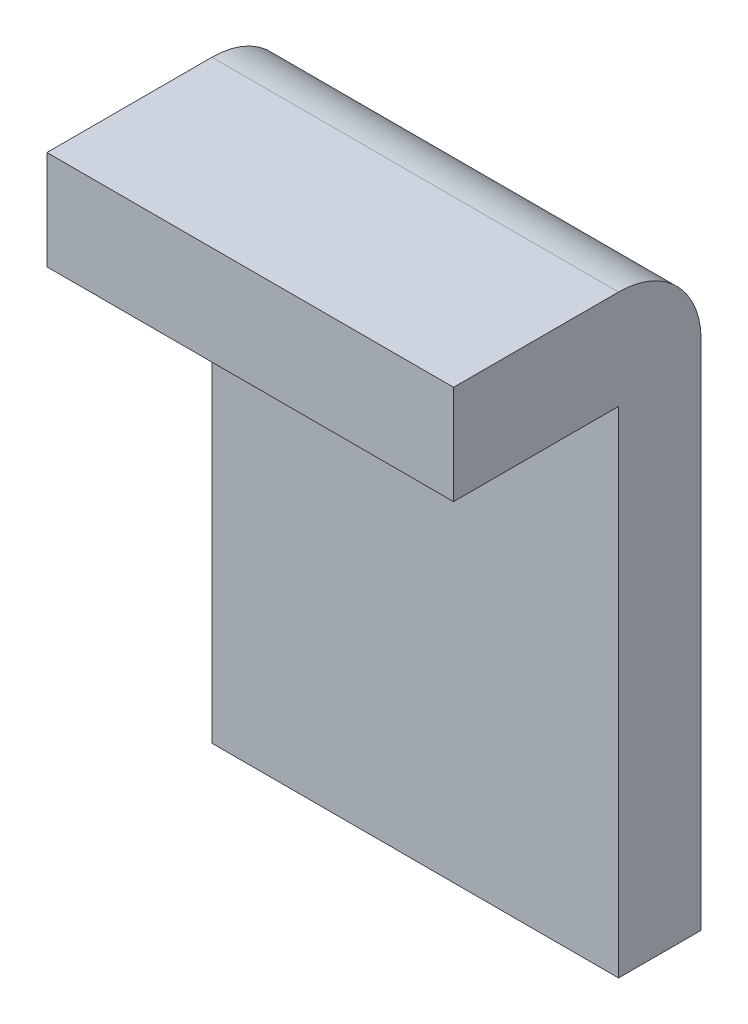
ISO-10303-21;
HEADER;
FILE_DESCRIPTION(('STEP AP214'),'2;1');
FILE_NAME('part.step','',(''),(''),'','','');
FILE_SCHEMA(('AUTOMOTIVE_DESIGN { 1 0 10303 214 1 1 1 1 }'));
ENDSEC;
DATA;
#1=APPLICATION_CONTEXT('core data for automotive mechanical design processes');
#2=APPLICATION_PROTOCOL_DEFINITION('international standard','automotive_design',2000,#1);
#3=PRODUCT_CONTEXT('',#1,'mechanical');
#4=PRODUCT('Part','Part','',(#3));
#5=PRODUCT_RELATED_PRODUCT_CATEGORY('part','',(#4));
#6=PRODUCT_DEFINITION_FORMATION('','',#4);
#7=PRODUCT_DEFINITION_CONTEXT('part definition',#1,'design');
#8=PRODUCT_DEFINITION('design','',#6,#7);
#9=PRODUCT_DEFINITION_SHAPE('','',#8);
#10=(LENGTH_UNIT() NAMED_UNIT(*) SI_UNIT(.MILLI.,.METRE.));
#11=(NAMED_UNIT(*) PLANE_ANGLE_UNIT() SI_UNIT($,.RADIAN.));
#12=(NAMED_UNIT(*) SI_UNIT($,.STERADIAN.) SOLID_ANGLE_UNIT());
#13=UNCERTAINTY_MEASURE_WITH_UNIT(LENGTH_MEASURE(1.E-05),#10,'distance_accuracy_value','');
#14=(GEOMETRIC_REPRESENTATION_CONTEXT(3) GLOBAL_UNCERTAINTY_ASSIGNED_CONTEXT((#13)) GLOBAL_UNIT_ASSIGNED_CONTEXT((#10,
#11,#12)) REPRESENTATION_CONTEXT('',''));
#15=CARTESIAN_POINT('',(0.,0.,0.));
#16=DIRECTION('',(0.,0.,1.));
#17=DIRECTION('',(1.,0.,0.));
#18=AXIS2_PLACEMENT_3D('',#15,#16,#17);
#19=CARTESIAN_POINT('',(-8.34906661620967,8.30000000000001,4.25467377707551));
#20=DIRECTION('',(0.,1.,0.));
#21=DIRECTION('',(0.,0.,1.));
#22=AXIS2_PLACEMENT_3D('',#19,#20,#21);
#23=PLANE('',#22);
#24=DIRECTION('',(1.,0.,0.));
#25=VECTOR('',#24,1.);
#26=CARTESIAN_POINT('',(-3.38158711942134,8.30000000000001,4.25467377707552));
#27=LINE('',#26,#25);
#28=CARTESIAN_POINT('',(-3.38158711942134,8.30000000000001,4.25467377707551));
#29=VERTEX_POINT('',#28);
#30=CARTESIAN_POINT('',(-2.14943636298061,8.30000000000001,4.25467377707551));
#31=VERTEX_POINT('',#30);
#32=EDGE_CURVE('E133',#29,#31,#27,.T.);
#33=ORIENTED_EDGE('',*,*,#32,.F.);
#34=DIRECTION('',(0.,0.,1.));
#35=VECTOR('',#34,1.);
#36=CARTESIAN_POINT('',(-3.38158711942134,8.30000000000001,4.25467377707553));
#37=LINE('',#36,#35);
#38=CARTESIAN_POINT('',(-3.38158711942134,8.30000000000001,3.75467377707551));
#39=VERTEX_POINT('',#38);
#40=EDGE_CURVE('E113',#39,#29,#37,.T.);
#41=ORIENTED_EDGE('',*,*,#40,.F.);
#42=DIRECTION('',(1.,0.,0.));
#43=VECTOR('',#42,1.);
#44=CARTESIAN_POINT('',(-8.34906661620967,8.30000000000001,3.75467377707551));
#45=LINE('',#44,#43);
#46=CARTESIAN_POINT('',(-2.14943636298061,8.30000000000001,3.75467377707551));
#47=VERTEX_POINT('',#46);
#48=EDGE_CURVE('E130',#39,#47,#45,.T.);
#49=ORIENTED_EDGE('',*,*,#48,.T.);
#50=DIRECTION('',(0.,0.,-1.));
#51=VECTOR('',#50,1.);
#52=CARTESIAN_POINT('',(-2.14943636298061,8.30000000000001,4.25467377707553));
#53=LINE('',#52,#51);
#54=EDGE_CURVE('E129',#31,#47,#53,.T.);
#55=ORIENTED_EDGE('',*,*,#54,.F.);
#56=EDGE_LOOP('',(#33,#41,#49,#55));
#57=FACE_BOUND('',#56,.T.);
#58=ADVANCED_FACE('F17',(#57),#23,.F.);
#59=CARTESIAN_POINT('',(-3.38158711942134,5.35753839337144,4.25467377707553));
#60=DIRECTION('',(0.,0.,1.));
#61=DIRECTION('',(0.,-1.,0.));
#62=AXIS2_PLACEMENT_3D('',#59,#60,#61);
#63=PLANE('',#62);
#64=DIRECTION('',(1.,0.,0.));
#65=VECTOR('',#64,1.);
#66=CARTESIAN_POINT('',(-8.34906661620967,8.6,4.25467377707551));
#67=LINE('',#66,#65);
#68=CARTESIAN_POINT('',(-2.14943636298061,8.6,4.25467377707551));
#69=VERTEX_POINT('',#68);
#70=CARTESIAN_POINT('',(-3.38158711942134,8.6,4.25467377707551));
#71=VERTEX_POINT('',#70);
#72=EDGE_CURVE('E131',#69,#71,#67,.F.);
#73=ORIENTED_EDGE('',*,*,#72,.T.);
#74=DIRECTION('',(0.,1.,0.));
#75=VECTOR('',#74,1.);
#76=CARTESIAN_POINT('',(-3.38158711942134,5.35753839337144,4.25467377707551));
#77=LINE('',#76,#75);
#78=EDGE_CURVE('E136',#29,#71,#77,.T.);
#79=ORIENTED_EDGE('',*,*,#78,.F.);
#80=ORIENTED_EDGE('',*,*,#32,.T.);
#81=DIRECTION('',(0.,1.,0.));
#82=VECTOR('',#81,1.);
#83=CARTESIAN_POINT('',(-2.14943636298061,5.35753839337144,4.25467377707551));
#84=LINE('',#83,#82);
#85=EDGE_CURVE('E120',#69,#31,#84,.F.);
#86=ORIENTED_EDGE('',*,*,#85,.F.);
#87=EDGE_LOOP('',(#73,#79,#80,#86));
#88=FACE_BOUND('',#87,.T.);
#89=ADVANCED_FACE('F172',(#88),#63,.T.);
#90=CARTESIAN_POINT('',(-8.34906661620967,8.6,4.25467377707551));
#91=DIRECTION('',(0.,-1.,0.));
#92=DIRECTION('',(0.,0.,-1.));
#93=AXIS2_PLACEMENT_3D('',#90,#91,#92);
#94=PLANE('',#93);
#95=DIRECTION('',(1.,0.,0.));
#96=VECTOR('',#95,1.);
#97=CARTESIAN_POINT('',(-8.34906661620967,8.6,3.75467377707551));
#98=LINE('',#97,#96);
#99=CARTESIAN_POINT('',(-3.38158711942134,8.6,3.7546737770755));
#100=VERTEX_POINT('',#99);
#101=CARTESIAN_POINT('',(-2.14943636298061,8.6,3.7546737770755));
#102=VERTEX_POINT('',#101);
#103=EDGE_CURVE('E79',#100,#102,#98,.T.);
#104=ORIENTED_EDGE('',*,*,#103,.F.);
#105=DIRECTION('',(0.,0.,1.));
#106=VECTOR('',#105,1.);
#107=CARTESIAN_POINT('',(-3.38158711942134,8.6,4.25467377707553));
#108=LINE('',#107,#106);
#109=EDGE_CURVE('E139',#71,#100,#108,.F.);
#110=ORIENTED_EDGE('',*,*,#109,.F.);
#111=ORIENTED_EDGE('',*,*,#72,.F.);
#112=DIRECTION('',(0.,0.,-1.));
#113=VECTOR('',#112,1.);
#114=CARTESIAN_POINT('',(-2.14943636298061,8.6,4.25467377707553));
#115=LINE('',#114,#113);
#116=EDGE_CURVE('E83',#102,#69,#115,.F.);
#117=ORIENTED_EDGE('',*,*,#116,.F.);
#118=EDGE_LOOP('',(#104,#110,#111,#117));
#119=FACE_BOUND('',#118,.T.);
#120=ADVANCED_FACE('F169',(#119),#94,.F.);
#121=CARTESIAN_POINT('',(-8.34906661620967,8.30000000000001,3.75467377707551));
#122=DIRECTION('',(0.,0.,-1.));
#123=DIRECTION('',(0.,1.,0.));
#124=AXIS2_PLACEMENT_3D('',#121,#122,#123);
#125=PLANE('',#124);
#126=ORIENTED_EDGE('',*,*,#48,.F.);
#127=DIRECTION('',(0.,1.,0.));
#128=VECTOR('',#127,1.);
#129=CARTESIAN_POINT('',(-3.38158711942134,5.35753839337144,3.75467377707551));
#130=LINE('',#129,#128);
#131=CARTESIAN_POINT('',(-3.38158711942134,6.8,3.75467377707551));
#132=VERTEX_POINT('',#131);
#133=EDGE_CURVE('E95',#132,#39,#130,.T.);
#134=ORIENTED_EDGE('',*,*,#133,.F.);
#135=DIRECTION('',(1.,0.,0.));
#136=VECTOR('',#135,1.);
#137=CARTESIAN_POINT('',(-15.8147962412963,6.8,3.75467377707551));
#138=LINE('',#137,#136);
#139=CARTESIAN_POINT('',(-2.14943636298061,6.8,3.75467377707551));
#140=VERTEX_POINT('',#139);
#141=EDGE_CURVE('E114',#140,#132,#138,.F.);
#142=ORIENTED_EDGE('',*,*,#141,.F.);
#143=DIRECTION('',(0.,1.,0.));
#144=VECTOR('',#143,1.);
#145=CARTESIAN_POINT('',(-2.14943636298061,5.35753839337144,3.75467377707551));
#146=LINE('',#145,#144);
#147=EDGE_CURVE('E84',#47,#140,#146,.F.);
#148=ORIENTED_EDGE('',*,*,#147,.F.);
#149=EDGE_LOOP('',(#126,#134,#142,#148));
#150=FACE_BOUND('',#149,.T.);
#151=ADVANCED_FACE('F178',(#150),#125,.F.);
#152=CARTESIAN_POINT('',(-8.34906661620967,8.35,3.7546737770755));
#153=DIRECTION('',(1.,0.,0.));
#154=DIRECTION('',(0.,0.,-1.));
#155=AXIS2_PLACEMENT_3D('',#152,#153,#154);
#156=CYLINDRICAL_SURFACE('',#155,0.249999999999996);
#157=CARTESIAN_POINT('',(-3.38158711942134,8.35,3.7546737770755));
#158=DIRECTION('',(1.,0.,0.));
#159=DIRECTION('',(0.,0.,-1.));
#160=AXIS2_PLACEMENT_3D('',#157,#158,#159);
#161=CIRCLE('',#160,0.249999999999996);
#162=CARTESIAN_POINT('',(-3.38158711942134,8.35,3.50467377707551));
#163=VERTEX_POINT('',#162);
#164=EDGE_CURVE('E106',#100,#163,#161,.F.);
#165=ORIENTED_EDGE('',*,*,#164,.F.);
#166=ORIENTED_EDGE('',*,*,#103,.T.);
#167=CARTESIAN_POINT('',(-2.14943636298061,8.35,3.7546737770755));
#168=DIRECTION('',(1.,0.,0.));
#169=DIRECTION('',(0.,0.,-1.));
#170=AXIS2_PLACEMENT_3D('',#167,#168,#169);
#171=CIRCLE('',#170,0.249999999999996);
#172=CARTESIAN_POINT('',(-2.14943636298061,8.35,3.50467377707551));
#173=VERTEX_POINT('',#172);
#174=EDGE_CURVE('E20',#173,#102,#171,.T.);
#175=ORIENTED_EDGE('',*,*,#174,.F.);
#176=DIRECTION('',(1.,0.,0.));
#177=VECTOR('',#176,1.);
#178=CARTESIAN_POINT('',(-3.38158711942134,8.35,3.50467377707551));
#179=LINE('',#178,#177);
#180=EDGE_CURVE('E77',#163,#173,#179,.T.);
#181=ORIENTED_EDGE('',*,*,#180,.F.);
#182=EDGE_LOOP('',(#165,#166,#175,#181));
#183=FACE_BOUND('',#182,.T.);
#184=ADVANCED_FACE('F75',(#183),#156,.T.);
#185=CARTESIAN_POINT('',(-2.14943636298061,5.35753839337144,4.25467377707553));
#186=DIRECTION('',(1.,0.,0.));
#187=DIRECTION('',(0.,0.,-1.));
#188=AXIS2_PLACEMENT_3D('',#185,#186,#187);
#189=PLANE('',#188);
#190=ORIENTED_EDGE('',*,*,#116,.T.);
#191=ORIENTED_EDGE('',*,*,#85,.T.);
#192=ORIENTED_EDGE('',*,*,#54,.T.);
#193=ORIENTED_EDGE('',*,*,#147,.T.);
#194=DIRECTION('',(0.,0.,-1.));
#195=VECTOR('',#194,1.);
#196=CARTESIAN_POINT('',(-2.14943636298061,6.80000000000003,12.5046737770755));
#197=LINE('',#196,#195);
#198=CARTESIAN_POINT('',(-2.14943636298061,6.8,3.50467377707552));
#199=VERTEX_POINT('',#198);
#200=EDGE_CURVE('E90',#199,#140,#197,.F.);
#201=ORIENTED_EDGE('',*,*,#200,.F.);
#202=DIRECTION('',(0.,1.,0.));
#203=VECTOR('',#202,1.);
#204=CARTESIAN_POINT('',(-2.14943636298061,5.35753839337143,3.50467377707553));
#205=LINE('',#204,#203);
#206=EDGE_CURVE('E86',#173,#199,#205,.F.);
#207=ORIENTED_EDGE('',*,*,#206,.F.);
#208=ORIENTED_EDGE('',*,*,#174,.T.);
#209=EDGE_LOOP('',(#190,#191,#192,#193,#201,#207,#208));
#210=FACE_BOUND('',#209,.T.);
#211=ADVANCED_FACE('F87',(#210),#189,.T.);
#212=CARTESIAN_POINT('',(-15.8147962412963,6.80000000000003,12.5046737770755));
#213=DIRECTION('',(0.,-1.,0.));
#214=DIRECTION('',(0.,0.,-1.));
#215=AXIS2_PLACEMENT_3D('',#212,#213,#214);
#216=PLANE('',#215);
#217=DIRECTION('',(1.,0.,0.));
#218=VECTOR('',#217,1.);
#219=CARTESIAN_POINT('',(-3.38158711942134,6.8,3.50467377707552));
#220=LINE('',#219,#218);
#221=CARTESIAN_POINT('',(-3.38158711942134,6.8,3.50467377707552));
#222=VERTEX_POINT('',#221);
#223=EDGE_CURVE('E26',#199,#222,#220,.F.);
#224=ORIENTED_EDGE('',*,*,#223,.F.);
#225=ORIENTED_EDGE('',*,*,#200,.T.);
#226=ORIENTED_EDGE('',*,*,#141,.T.);
#227=DIRECTION('',(0.,0.,1.));
#228=VECTOR('',#227,1.);
#229=CARTESIAN_POINT('',(-3.38158711942134,6.8,4.25467377707553));
#230=LINE('',#229,#228);
#231=EDGE_CURVE('E35',#222,#132,#230,.T.);
#232=ORIENTED_EDGE('',*,*,#231,.F.);
#233=EDGE_LOOP('',(#224,#225,#226,#232));
#234=FACE_BOUND('',#233,.T.);
#235=ADVANCED_FACE('F179',(#234),#216,.T.);
#236=CARTESIAN_POINT('',(-3.38158711942134,5.35753839337144,4.25467377707553));
#237=DIRECTION('',(-1.,0.,0.));
#238=DIRECTION('',(0.,0.,1.));
#239=AXIS2_PLACEMENT_3D('',#236,#237,#238);
#240=PLANE('',#239);
#241=ORIENTED_EDGE('',*,*,#231,.T.);
#242=ORIENTED_EDGE('',*,*,#133,.T.);
#243=ORIENTED_EDGE('',*,*,#40,.T.);
#244=ORIENTED_EDGE('',*,*,#78,.T.);
#245=ORIENTED_EDGE('',*,*,#109,.T.);
#246=ORIENTED_EDGE('',*,*,#164,.T.);
#247=DIRECTION('',(0.,1.,0.));
#248=VECTOR('',#247,1.);
#249=CARTESIAN_POINT('',(-3.38158711942134,5.35753839337143,3.50467377707553));
#250=LINE('',#249,#248);
#251=EDGE_CURVE('E11',#222,#163,#250,.T.);
#252=ORIENTED_EDGE('',*,*,#251,.F.);
#253=EDGE_LOOP('',(#241,#242,#243,#244,#245,#246,#252));
#254=FACE_BOUND('',#253,.T.);
#255=ADVANCED_FACE('F166',(#254),#240,.T.);
#256=CARTESIAN_POINT('',(-3.38158711942134,5.35753839337143,3.50467377707553));
#257=DIRECTION('',(0.,0.,-1.));
#258=DIRECTION('',(0.,1.,0.));
#259=AXIS2_PLACEMENT_3D('',#256,#257,#258);
#260=PLANE('',#259);
#261=ORIENTED_EDGE('',*,*,#223,.T.);
#262=ORIENTED_EDGE('',*,*,#251,.T.);
#263=ORIENTED_EDGE('',*,*,#180,.T.);
#264=ORIENTED_EDGE('',*,*,#206,.T.);
#265=EDGE_LOOP('',(#261,#262,#263,#264));
#266=FACE_BOUND('',#265,.T.);
#267=ADVANCED_FACE('F94',(#266),#260,.T.);
#268=CLOSED_SHELL('',(#58,#89,#120,#151,#184,#211,#235,#255,#267));
#269=MANIFOLD_SOLID_BREP('B1',#268);
#270=ADVANCED_BREP_SHAPE_REPRESENTATION('',(#18,#269),#14);
#271=SHAPE_DEFINITION_REPRESENTATION(#9,#270);
ENDSEC;
END-ISO-10303-21;
